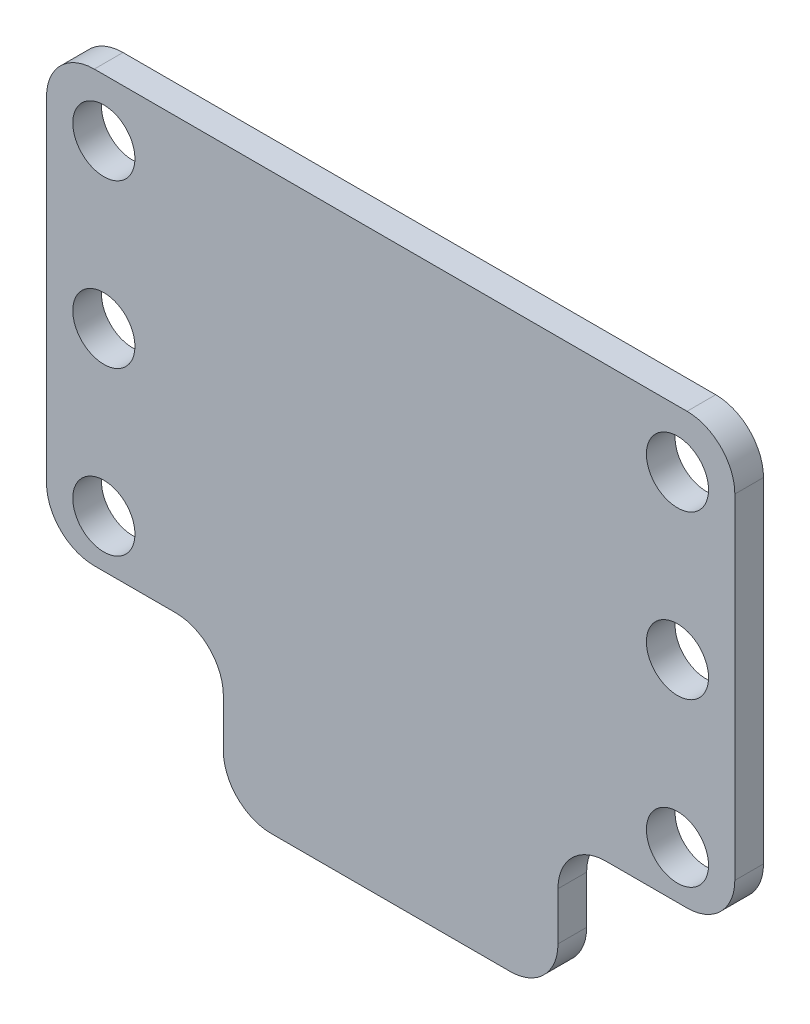
ISO-10303-21;
HEADER;
FILE_DESCRIPTION(('STEP AP214'),'2;1');
FILE_NAME('part.step','',(''),(''),'','','');
FILE_SCHEMA(('AUTOMOTIVE_DESIGN { 1 0 10303 214 1 1 1 1 }'));
ENDSEC;
DATA;
#1=APPLICATION_CONTEXT('core data for automotive mechanical design processes');
#2=APPLICATION_PROTOCOL_DEFINITION('international standard','automotive_design',2000,#1);
#3=PRODUCT_CONTEXT('',#1,'mechanical');
#4=PRODUCT('Part','Part','',(#3));
#5=PRODUCT_RELATED_PRODUCT_CATEGORY('part','',(#4));
#6=PRODUCT_DEFINITION_FORMATION('','',#4);
#7=PRODUCT_DEFINITION_CONTEXT('part definition',#1,'design');
#8=PRODUCT_DEFINITION('design','',#6,#7);
#9=PRODUCT_DEFINITION_SHAPE('','',#8);
#10=(LENGTH_UNIT() NAMED_UNIT(*) SI_UNIT(.MILLI.,.METRE.));
#11=(NAMED_UNIT(*) PLANE_ANGLE_UNIT() SI_UNIT($,.RADIAN.));
#12=(NAMED_UNIT(*) SI_UNIT($,.STERADIAN.) SOLID_ANGLE_UNIT());
#13=UNCERTAINTY_MEASURE_WITH_UNIT(LENGTH_MEASURE(1.E-05),#10,'distance_accuracy_value','');
#14=(GEOMETRIC_REPRESENTATION_CONTEXT(3) GLOBAL_UNCERTAINTY_ASSIGNED_CONTEXT((#13)) GLOBAL_UNIT_ASSIGNED_CONTEXT((#10,
#11,#12)) REPRESENTATION_CONTEXT('',''));
#15=CARTESIAN_POINT('',(0.,0.,0.));
#16=DIRECTION('',(0.,0.,1.));
#17=DIRECTION('',(1.,0.,0.));
#18=AXIS2_PLACEMENT_3D('',#15,#16,#17);
#19=CARTESIAN_POINT('',(0.,0.,3.));
#20=DIRECTION('',(0.,0.,-1.));
#21=DIRECTION('',(-1.,0.,0.));
#22=AXIS2_PLACEMENT_3D('',#19,#20,#21);
#23=PLANE('',#22);
#24=DIRECTION('',(-1.,0.,0.));
#25=VECTOR('',#24,1.);
#26=CARTESIAN_POINT('',(109.208492458902,1.90147341211937,3.));
#27=LINE('',#26,#25);
#28=CARTESIAN_POINT('',(104.208492458902,1.90147341211937,3.));
#29=VERTEX_POINT('',#28);
#30=CARTESIAN_POINT('',(42.2084924589015,1.90147341211937,3.));
#31=VERTEX_POINT('',#30);
#32=EDGE_CURVE('E286',#29,#31,#27,.T.);
#33=ORIENTED_EDGE('',*,*,#32,.T.);
#34=CARTESIAN_POINT('',(42.2084924589015,-3.09852658788063,3.));
#35=DIRECTION('',(0.,0.,-1.));
#36=DIRECTION('',(-1.,0.,0.));
#37=AXIS2_PLACEMENT_3D('',#34,#35,#36);
#38=CIRCLE('',#37,5.);
#39=CARTESIAN_POINT('',(37.2084924589015,-3.09852658788063,3.));
#40=VERTEX_POINT('',#39);
#41=EDGE_CURVE('E216',#31,#40,#38,.F.);
#42=ORIENTED_EDGE('',*,*,#41,.T.);
#43=DIRECTION('',(0.,-1.,0.));
#44=VECTOR('',#43,1.);
#45=CARTESIAN_POINT('',(37.2084924589015,1.90147341211937,3.));
#46=LINE('',#45,#44);
#47=CARTESIAN_POINT('',(37.2084924589015,-38.0985265878806,3.));
#48=VERTEX_POINT('',#47);
#49=EDGE_CURVE('E165',#40,#48,#46,.T.);
#50=ORIENTED_EDGE('',*,*,#49,.T.);
#51=CARTESIAN_POINT('',(42.2084924589015,-38.0985265878806,3.));
#52=DIRECTION('',(0.,0.,-1.));
#53=DIRECTION('',(-1.,0.,0.));
#54=AXIS2_PLACEMENT_3D('',#51,#52,#53);
#55=CIRCLE('',#54,5.);
#56=CARTESIAN_POINT('',(42.2084924589015,-43.0985265878806,3.));
#57=VERTEX_POINT('',#56);
#58=EDGE_CURVE('E214',#48,#57,#55,.F.);
#59=ORIENTED_EDGE('',*,*,#58,.T.);
#60=DIRECTION('',(1.,0.,0.));
#61=VECTOR('',#60,1.);
#62=CARTESIAN_POINT('',(55.7084924589017,-43.0985265878806,3.));
#63=LINE('',#62,#61);
#64=CARTESIAN_POINT('',(50.7084924589017,-43.0985265878806,3.));
#65=VERTEX_POINT('',#64);
#66=EDGE_CURVE('E290',#57,#65,#63,.T.);
#67=ORIENTED_EDGE('',*,*,#66,.T.);
#68=CARTESIAN_POINT('',(50.7084924589017,-48.0985265878806,3.));
#69=DIRECTION('',(0.,0.,-1.));
#70=DIRECTION('',(-1.,0.,0.));
#71=AXIS2_PLACEMENT_3D('',#68,#69,#70);
#72=CIRCLE('',#71,5.);
#73=CARTESIAN_POINT('',(55.7084924589017,-48.0985265878806,3.));
#74=VERTEX_POINT('',#73);
#75=EDGE_CURVE('E249',#65,#74,#72,.T.);
#76=ORIENTED_EDGE('',*,*,#75,.T.);
#77=DIRECTION('',(0.,-1.,0.));
#78=VECTOR('',#77,1.);
#79=CARTESIAN_POINT('',(55.7084924589017,-43.0985265878806,3.));
#80=LINE('',#79,#78);
#81=CARTESIAN_POINT('',(55.7084924589017,-53.0985265878806,3.));
#82=VERTEX_POINT('',#81);
#83=EDGE_CURVE('E293',#74,#82,#80,.T.);
#84=ORIENTED_EDGE('',*,*,#83,.T.);
#85=CARTESIAN_POINT('',(60.7084924589017,-53.0985265878806,3.));
#86=DIRECTION('',(0.,0.,-1.));
#87=DIRECTION('',(-1.,0.,0.));
#88=AXIS2_PLACEMENT_3D('',#85,#86,#87);
#89=CIRCLE('',#88,5.);
#90=CARTESIAN_POINT('',(60.7084924589017,-58.0985265878806,3.));
#91=VERTEX_POINT('',#90);
#92=EDGE_CURVE('E212',#82,#91,#89,.F.);
#93=ORIENTED_EDGE('',*,*,#92,.T.);
#94=DIRECTION('',(1.,0.,0.));
#95=VECTOR('',#94,1.);
#96=CARTESIAN_POINT('',(90.7084924589017,-58.0985265878806,3.));
#97=LINE('',#96,#95);
#98=CARTESIAN_POINT('',(85.7084924589017,-58.0985265878806,3.));
#99=VERTEX_POINT('',#98);
#100=EDGE_CURVE('E264',#91,#99,#97,.T.);
#101=ORIENTED_EDGE('',*,*,#100,.T.);
#102=CARTESIAN_POINT('',(85.7084924589017,-53.0985265878806,3.));
#103=DIRECTION('',(0.,0.,-1.));
#104=DIRECTION('',(-1.,0.,0.));
#105=AXIS2_PLACEMENT_3D('',#102,#103,#104);
#106=CIRCLE('',#105,5.);
#107=CARTESIAN_POINT('',(90.7084924589017,-53.0985265878806,3.));
#108=VERTEX_POINT('',#107);
#109=EDGE_CURVE('E210',#99,#108,#106,.F.);
#110=ORIENTED_EDGE('',*,*,#109,.T.);
#111=DIRECTION('',(0.,1.,0.));
#112=VECTOR('',#111,1.);
#113=CARTESIAN_POINT('',(90.7084924589017,-43.0985265878806,3.));
#114=LINE('',#113,#112);
#115=CARTESIAN_POINT('',(90.7084924589017,-48.0985265878806,3.));
#116=VERTEX_POINT('',#115);
#117=EDGE_CURVE('E262',#108,#116,#114,.T.);
#118=ORIENTED_EDGE('',*,*,#117,.T.);
#119=CARTESIAN_POINT('',(95.7084924589017,-48.0985265878806,3.));
#120=DIRECTION('',(0.,0.,-1.));
#121=DIRECTION('',(-1.,0.,0.));
#122=AXIS2_PLACEMENT_3D('',#119,#120,#121);
#123=CIRCLE('',#122,5.);
#124=CARTESIAN_POINT('',(95.7084924589017,-43.0985265878806,3.));
#125=VERTEX_POINT('',#124);
#126=EDGE_CURVE('E11',#116,#125,#123,.T.);
#127=ORIENTED_EDGE('',*,*,#126,.T.);
#128=DIRECTION('',(1.,0.,0.));
#129=VECTOR('',#128,1.);
#130=CARTESIAN_POINT('',(109.208492458902,-43.0985265878806,3.));
#131=LINE('',#130,#129);
#132=CARTESIAN_POINT('',(104.208492458902,-43.0985265878806,3.));
#133=VERTEX_POINT('',#132);
#134=EDGE_CURVE('E193',#125,#133,#131,.T.);
#135=ORIENTED_EDGE('',*,*,#134,.T.);
#136=CARTESIAN_POINT('',(104.208492458902,-38.0985265878806,3.));
#137=DIRECTION('',(0.,0.,-1.));
#138=DIRECTION('',(-1.,0.,0.));
#139=AXIS2_PLACEMENT_3D('',#136,#137,#138);
#140=CIRCLE('',#139,5.);
#141=CARTESIAN_POINT('',(109.208492458902,-38.0985265878806,3.));
#142=VERTEX_POINT('',#141);
#143=EDGE_CURVE('E208',#133,#142,#140,.F.);
#144=ORIENTED_EDGE('',*,*,#143,.T.);
#145=DIRECTION('',(0.,1.,0.));
#146=VECTOR('',#145,1.);
#147=CARTESIAN_POINT('',(109.208492458902,1.90147341211937,3.));
#148=LINE('',#147,#146);
#149=CARTESIAN_POINT('',(109.208492458902,-3.09852658788063,3.));
#150=VERTEX_POINT('',#149);
#151=EDGE_CURVE('E192',#142,#150,#148,.T.);
#152=ORIENTED_EDGE('',*,*,#151,.T.);
#153=CARTESIAN_POINT('',(104.208492458902,-3.09852658788063,3.));
#154=DIRECTION('',(0.,0.,-1.));
#155=DIRECTION('',(-1.,0.,0.));
#156=AXIS2_PLACEMENT_3D('',#153,#154,#155);
#157=CIRCLE('',#156,5.);
#158=EDGE_CURVE('E206',#150,#29,#157,.F.);
#159=ORIENTED_EDGE('',*,*,#158,.T.);
#160=EDGE_LOOP('',(#33,#42,#50,#59,#67,#76,#84,#93,#101,#110,#118,#127,#135,#144,#152,#159));
#161=FACE_BOUND('',#160,.T.);
#162=CARTESIAN_POINT('',(103.208492458902,-4.09852658788064,3.));
#163=DIRECTION('',(0.,0.,1.));
#164=DIRECTION('',(1.,0.,0.));
#165=AXIS2_PLACEMENT_3D('',#162,#163,#164);
#166=CIRCLE('',#165,3.25000000000001);
#167=CARTESIAN_POINT('',(106.458492458902,-4.09852658788064,3.));
#168=VERTEX_POINT('',#167);
#169=EDGE_CURVE('E268',#168,#168,#166,.T.);
#170=ORIENTED_EDGE('',*,*,#169,.F.);
#171=EDGE_LOOP('',(#170));
#172=FACE_BOUND('',#171,.T.);
#173=CARTESIAN_POINT('',(103.208492458902,-38.0985265878806,3.));
#174=DIRECTION('',(0.,0.,1.));
#175=DIRECTION('',(1.,0.,0.));
#176=AXIS2_PLACEMENT_3D('',#173,#174,#175);
#177=CIRCLE('',#176,3.25000000000001);
#178=CARTESIAN_POINT('',(106.458492458902,-38.0985265878806,3.));
#179=VERTEX_POINT('',#178);
#180=EDGE_CURVE('E278',#179,#179,#177,.T.);
#181=ORIENTED_EDGE('',*,*,#180,.F.);
#182=EDGE_LOOP('',(#181));
#183=FACE_BOUND('',#182,.T.);
#184=CARTESIAN_POINT('',(43.2084924589015,-38.0985265878802,3.));
#185=DIRECTION('',(0.,0.,1.));
#186=DIRECTION('',(1.,0.,0.));
#187=AXIS2_PLACEMENT_3D('',#184,#185,#186);
#188=CIRCLE('',#187,3.25000000000001);
#189=CARTESIAN_POINT('',(46.4584924589015,-38.0985265878802,3.));
#190=VERTEX_POINT('',#189);
#191=EDGE_CURVE('E563',#190,#190,#188,.T.);
#192=ORIENTED_EDGE('',*,*,#191,.F.);
#193=EDGE_LOOP('',(#192));
#194=FACE_BOUND('',#193,.T.);
#195=CARTESIAN_POINT('',(43.2084924589015,-4.09852658788018,3.));
#196=DIRECTION('',(0.,0.,1.));
#197=DIRECTION('',(1.,0.,0.));
#198=AXIS2_PLACEMENT_3D('',#195,#196,#197);
#199=CIRCLE('',#198,3.25);
#200=CARTESIAN_POINT('',(46.4584924589015,-4.09852658788018,3.));
#201=VERTEX_POINT('',#200);
#202=EDGE_CURVE('E557',#201,#201,#199,.T.);
#203=ORIENTED_EDGE('',*,*,#202,.F.);
#204=EDGE_LOOP('',(#203));
#205=FACE_BOUND('',#204,.T.);
#206=CARTESIAN_POINT('',(43.2084924589015,-21.0985265878802,3.));
#207=DIRECTION('',(0.,0.,1.));
#208=DIRECTION('',(1.,0.,0.));
#209=AXIS2_PLACEMENT_3D('',#206,#207,#208);
#210=CIRCLE('',#209,3.25);
#211=CARTESIAN_POINT('',(46.4584924589015,-21.0985265878802,3.));
#212=VERTEX_POINT('',#211);
#213=EDGE_CURVE('E551',#212,#212,#210,.T.);
#214=ORIENTED_EDGE('',*,*,#213,.F.);
#215=EDGE_LOOP('',(#214));
#216=FACE_BOUND('',#215,.T.);
#217=CARTESIAN_POINT('',(103.208492458902,-21.0985265878802,3.));
#218=DIRECTION('',(0.,0.,1.));
#219=DIRECTION('',(1.,0.,0.));
#220=AXIS2_PLACEMENT_3D('',#217,#218,#219);
#221=CIRCLE('',#220,3.25000000000001);
#222=CARTESIAN_POINT('',(106.458492458902,-21.0985265878802,3.));
#223=VERTEX_POINT('',#222);
#224=EDGE_CURVE('E542',#223,#223,#221,.T.);
#225=ORIENTED_EDGE('',*,*,#224,.F.);
#226=EDGE_LOOP('',(#225));
#227=FACE_BOUND('',#226,.T.);
#228=ADVANCED_FACE('F32',(#161,#172,#183,#194,#205,#216,#227),#23,.F.);
#229=CARTESIAN_POINT('',(0.,0.,0.));
#230=DIRECTION('',(0.,0.,-1.));
#231=DIRECTION('',(-1.,0.,0.));
#232=AXIS2_PLACEMENT_3D('',#229,#230,#231);
#233=PLANE('',#232);
#234=CARTESIAN_POINT('',(43.2084924589015,-21.0985265878802,0.));
#235=DIRECTION('',(0.,0.,1.));
#236=DIRECTION('',(1.,0.,0.));
#237=AXIS2_PLACEMENT_3D('',#234,#235,#236);
#238=CIRCLE('',#237,3.25);
#239=CARTESIAN_POINT('',(46.4584924589015,-21.0985265878802,0.));
#240=VERTEX_POINT('',#239);
#241=EDGE_CURVE('E548',#240,#240,#238,.T.);
#242=ORIENTED_EDGE('',*,*,#241,.T.);
#243=EDGE_LOOP('',(#242));
#244=FACE_BOUND('',#243,.T.);
#245=CARTESIAN_POINT('',(43.2084924589015,-38.0985265878802,0.));
#246=DIRECTION('',(0.,0.,1.));
#247=DIRECTION('',(1.,0.,0.));
#248=AXIS2_PLACEMENT_3D('',#245,#246,#247);
#249=CIRCLE('',#248,3.25000000000001);
#250=CARTESIAN_POINT('',(46.4584924589015,-38.0985265878802,0.));
#251=VERTEX_POINT('',#250);
#252=EDGE_CURVE('E560',#251,#251,#249,.T.);
#253=ORIENTED_EDGE('',*,*,#252,.T.);
#254=EDGE_LOOP('',(#253));
#255=FACE_BOUND('',#254,.T.);
#256=CARTESIAN_POINT('',(103.208492458902,-4.09852658788064,0.));
#257=DIRECTION('',(0.,0.,1.));
#258=DIRECTION('',(1.,0.,0.));
#259=AXIS2_PLACEMENT_3D('',#256,#257,#258);
#260=CIRCLE('',#259,3.25000000000001);
#261=CARTESIAN_POINT('',(106.458492458902,-4.09852658788064,0.));
#262=VERTEX_POINT('',#261);
#263=EDGE_CURVE('E273',#262,#262,#260,.T.);
#264=ORIENTED_EDGE('',*,*,#263,.T.);
#265=EDGE_LOOP('',(#264));
#266=FACE_BOUND('',#265,.T.);
#267=DIRECTION('',(0.,-1.,0.));
#268=VECTOR('',#267,1.);
#269=CARTESIAN_POINT('',(37.2084924589015,1.90147341211937,0.));
#270=LINE('',#269,#268);
#271=CARTESIAN_POINT('',(37.2084924589015,-3.09852658788063,0.));
#272=VERTEX_POINT('',#271);
#273=CARTESIAN_POINT('',(37.2084924589015,-38.0985265878806,0.));
#274=VERTEX_POINT('',#273);
#275=EDGE_CURVE('E162',#272,#274,#270,.T.);
#276=ORIENTED_EDGE('',*,*,#275,.F.);
#277=CARTESIAN_POINT('',(42.2084924589015,-3.09852658788063,0.));
#278=DIRECTION('',(0.,0.,-1.));
#279=DIRECTION('',(-1.,0.,0.));
#280=AXIS2_PLACEMENT_3D('',#277,#278,#279);
#281=CIRCLE('',#280,5.);
#282=CARTESIAN_POINT('',(42.2084924589015,1.90147341211937,0.));
#283=VERTEX_POINT('',#282);
#284=EDGE_CURVE('E145',#272,#283,#281,.T.);
#285=ORIENTED_EDGE('',*,*,#284,.T.);
#286=DIRECTION('',(-1.,0.,0.));
#287=VECTOR('',#286,1.);
#288=CARTESIAN_POINT('',(109.208492458902,1.90147341211937,0.));
#289=LINE('',#288,#287);
#290=CARTESIAN_POINT('',(104.208492458902,1.90147341211937,0.));
#291=VERTEX_POINT('',#290);
#292=EDGE_CURVE('E173',#291,#283,#289,.T.);
#293=ORIENTED_EDGE('',*,*,#292,.F.);
#294=CARTESIAN_POINT('',(104.208492458902,-3.09852658788063,0.));
#295=DIRECTION('',(0.,0.,-1.));
#296=DIRECTION('',(-1.,0.,0.));
#297=AXIS2_PLACEMENT_3D('',#294,#295,#296);
#298=CIRCLE('',#297,5.);
#299=CARTESIAN_POINT('',(109.208492458902,-3.09852658788063,0.));
#300=VERTEX_POINT('',#299);
#301=EDGE_CURVE('E166',#291,#300,#298,.T.);
#302=ORIENTED_EDGE('',*,*,#301,.T.);
#303=DIRECTION('',(0.,1.,0.));
#304=VECTOR('',#303,1.);
#305=CARTESIAN_POINT('',(109.208492458902,1.90147341211937,0.));
#306=LINE('',#305,#304);
#307=CARTESIAN_POINT('',(109.208492458902,-38.0985265878806,0.));
#308=VERTEX_POINT('',#307);
#309=EDGE_CURVE('E178',#308,#300,#306,.T.);
#310=ORIENTED_EDGE('',*,*,#309,.F.);
#311=CARTESIAN_POINT('',(104.208492458902,-38.0985265878806,0.));
#312=DIRECTION('',(0.,0.,-1.));
#313=DIRECTION('',(-1.,0.,0.));
#314=AXIS2_PLACEMENT_3D('',#311,#312,#313);
#315=CIRCLE('',#314,5.);
#316=CARTESIAN_POINT('',(104.208492458902,-43.0985265878806,0.));
#317=VERTEX_POINT('',#316);
#318=EDGE_CURVE('E196',#308,#317,#315,.T.);
#319=ORIENTED_EDGE('',*,*,#318,.T.);
#320=DIRECTION('',(1.,0.,0.));
#321=VECTOR('',#320,1.);
#322=CARTESIAN_POINT('',(109.208492458902,-43.0985265878806,0.));
#323=LINE('',#322,#321);
#324=CARTESIAN_POINT('',(95.7084924589017,-43.0985265878806,0.));
#325=VERTEX_POINT('',#324);
#326=EDGE_CURVE('E190',#325,#317,#323,.T.);
#327=ORIENTED_EDGE('',*,*,#326,.F.);
#328=CARTESIAN_POINT('',(95.7084924589017,-48.0985265878806,0.));
#329=DIRECTION('',(0.,0.,-1.));
#330=DIRECTION('',(-1.,0.,0.));
#331=AXIS2_PLACEMENT_3D('',#328,#329,#330);
#332=CIRCLE('',#331,5.);
#333=CARTESIAN_POINT('',(90.7084924589017,-48.0985265878806,0.));
#334=VERTEX_POINT('',#333);
#335=EDGE_CURVE('E40',#325,#334,#332,.F.);
#336=ORIENTED_EDGE('',*,*,#335,.T.);
#337=DIRECTION('',(0.,1.,0.));
#338=VECTOR('',#337,1.);
#339=CARTESIAN_POINT('',(90.7084924589017,-43.0985265878806,0.));
#340=LINE('',#339,#338);
#341=CARTESIAN_POINT('',(90.7084924589017,-53.0985265878806,0.));
#342=VERTEX_POINT('',#341);
#343=EDGE_CURVE('E187',#342,#334,#340,.T.);
#344=ORIENTED_EDGE('',*,*,#343,.F.);
#345=CARTESIAN_POINT('',(85.7084924589017,-53.0985265878806,0.));
#346=DIRECTION('',(0.,0.,-1.));
#347=DIRECTION('',(-1.,0.,0.));
#348=AXIS2_PLACEMENT_3D('',#345,#346,#347);
#349=CIRCLE('',#348,5.);
#350=CARTESIAN_POINT('',(85.7084924589017,-58.0985265878806,0.));
#351=VERTEX_POINT('',#350);
#352=EDGE_CURVE('E198',#342,#351,#349,.T.);
#353=ORIENTED_EDGE('',*,*,#352,.T.);
#354=DIRECTION('',(1.,0.,0.));
#355=VECTOR('',#354,1.);
#356=CARTESIAN_POINT('',(90.7084924589017,-58.0985265878806,0.));
#357=LINE('',#356,#355);
#358=CARTESIAN_POINT('',(60.7084924589017,-58.0985265878806,0.));
#359=VERTEX_POINT('',#358);
#360=EDGE_CURVE('E184',#359,#351,#357,.T.);
#361=ORIENTED_EDGE('',*,*,#360,.F.);
#362=CARTESIAN_POINT('',(60.7084924589017,-53.0985265878806,0.));
#363=DIRECTION('',(0.,0.,-1.));
#364=DIRECTION('',(-1.,0.,0.));
#365=AXIS2_PLACEMENT_3D('',#362,#363,#364);
#366=CIRCLE('',#365,5.);
#367=CARTESIAN_POINT('',(55.7084924589017,-53.0985265878806,0.));
#368=VERTEX_POINT('',#367);
#369=EDGE_CURVE('E200',#359,#368,#366,.T.);
#370=ORIENTED_EDGE('',*,*,#369,.T.);
#371=DIRECTION('',(0.,-1.,0.));
#372=VECTOR('',#371,1.);
#373=CARTESIAN_POINT('',(55.7084924589017,-43.0985265878806,0.));
#374=LINE('',#373,#372);
#375=CARTESIAN_POINT('',(55.7084924589017,-48.0985265878806,0.));
#376=VERTEX_POINT('',#375);
#377=EDGE_CURVE('E176',#376,#368,#374,.T.);
#378=ORIENTED_EDGE('',*,*,#377,.F.);
#379=CARTESIAN_POINT('',(50.7084924589017,-48.0985265878806,0.));
#380=DIRECTION('',(0.,0.,-1.));
#381=DIRECTION('',(-1.,0.,0.));
#382=AXIS2_PLACEMENT_3D('',#379,#380,#381);
#383=CIRCLE('',#382,5.);
#384=CARTESIAN_POINT('',(50.7084924589017,-43.0985265878806,0.));
#385=VERTEX_POINT('',#384);
#386=EDGE_CURVE('E247',#376,#385,#383,.F.);
#387=ORIENTED_EDGE('',*,*,#386,.T.);
#388=DIRECTION('',(1.,0.,0.));
#389=VECTOR('',#388,1.);
#390=CARTESIAN_POINT('',(55.7084924589017,-43.0985265878806,0.));
#391=LINE('',#390,#389);
#392=CARTESIAN_POINT('',(42.2084924589015,-43.0985265878806,0.));
#393=VERTEX_POINT('',#392);
#394=EDGE_CURVE('E172',#393,#385,#391,.T.);
#395=ORIENTED_EDGE('',*,*,#394,.F.);
#396=CARTESIAN_POINT('',(42.2084924589015,-38.0985265878806,0.));
#397=DIRECTION('',(0.,0.,-1.));
#398=DIRECTION('',(-1.,0.,0.));
#399=AXIS2_PLACEMENT_3D('',#396,#397,#398);
#400=CIRCLE('',#399,5.);
#401=EDGE_CURVE('E156',#393,#274,#400,.T.);
#402=ORIENTED_EDGE('',*,*,#401,.T.);
#403=EDGE_LOOP('',(#276,#285,#293,#302,#310,#319,#327,#336,#344,#353,#361,#370,#378,#387,#395,#402));
#404=FACE_BOUND('',#403,.T.);
#405=CARTESIAN_POINT('',(103.208492458902,-38.0985265878806,0.));
#406=DIRECTION('',(0.,0.,1.));
#407=DIRECTION('',(1.,0.,0.));
#408=AXIS2_PLACEMENT_3D('',#405,#406,#407);
#409=CIRCLE('',#408,3.25000000000001);
#410=CARTESIAN_POINT('',(106.458492458902,-38.0985265878806,0.));
#411=VERTEX_POINT('',#410);
#412=EDGE_CURVE('E281',#411,#411,#409,.T.);
#413=ORIENTED_EDGE('',*,*,#412,.T.);
#414=EDGE_LOOP('',(#413));
#415=FACE_BOUND('',#414,.T.);
#416=CARTESIAN_POINT('',(43.2084924589015,-4.09852658788018,0.));
#417=DIRECTION('',(0.,0.,1.));
#418=DIRECTION('',(1.,0.,0.));
#419=AXIS2_PLACEMENT_3D('',#416,#417,#418);
#420=CIRCLE('',#419,3.25);
#421=CARTESIAN_POINT('',(46.4584924589015,-4.09852658788018,0.));
#422=VERTEX_POINT('',#421);
#423=EDGE_CURVE('E554',#422,#422,#420,.T.);
#424=ORIENTED_EDGE('',*,*,#423,.T.);
#425=EDGE_LOOP('',(#424));
#426=FACE_BOUND('',#425,.T.);
#427=CARTESIAN_POINT('',(103.208492458902,-21.0985265878802,0.));
#428=DIRECTION('',(0.,0.,1.));
#429=DIRECTION('',(1.,0.,0.));
#430=AXIS2_PLACEMENT_3D('',#427,#428,#429);
#431=CIRCLE('',#430,3.25000000000001);
#432=CARTESIAN_POINT('',(106.458492458902,-21.0985265878802,0.));
#433=VERTEX_POINT('',#432);
#434=EDGE_CURVE('E545',#433,#433,#431,.T.);
#435=ORIENTED_EDGE('',*,*,#434,.T.);
#436=EDGE_LOOP('',(#435));
#437=FACE_BOUND('',#436,.T.);
#438=ADVANCED_FACE('F169',(#244,#255,#266,#404,#415,#426,#437),#233,.T.);
#439=CARTESIAN_POINT('',(109.208492458902,1.90147341211937,3.));
#440=DIRECTION('',(-1.,0.,0.));
#441=DIRECTION('',(0.,0.,1.));
#442=AXIS2_PLACEMENT_3D('',#439,#440,#441);
#443=PLANE('',#442);
#444=ORIENTED_EDGE('',*,*,#151,.F.);
#445=DIRECTION('',(0.,0.,-1.));
#446=VECTOR('',#445,1.);
#447=CARTESIAN_POINT('',(109.208492458902,-38.0985265878806,3.));
#448=LINE('',#447,#446);
#449=EDGE_CURVE('E244',#142,#308,#448,.T.);
#450=ORIENTED_EDGE('',*,*,#449,.T.);
#451=ORIENTED_EDGE('',*,*,#309,.T.);
#452=DIRECTION('',(0.,0.,-1.));
#453=VECTOR('',#452,1.);
#454=CARTESIAN_POINT('',(109.208492458902,-3.09852658788063,3.));
#455=LINE('',#454,#453);
#456=EDGE_CURVE('E242',#300,#150,#455,.F.);
#457=ORIENTED_EDGE('',*,*,#456,.T.);
#458=EDGE_LOOP('',(#444,#450,#451,#457));
#459=FACE_BOUND('',#458,.T.);
#460=ADVANCED_FACE('F336',(#459),#443,.F.);
#461=CARTESIAN_POINT('',(109.208492458902,1.90147341211937,3.));
#462=DIRECTION('',(0.,-1.,0.));
#463=DIRECTION('',(0.,0.,-1.));
#464=AXIS2_PLACEMENT_3D('',#461,#462,#463);
#465=PLANE('',#464);
#466=ORIENTED_EDGE('',*,*,#292,.T.);
#467=DIRECTION('',(0.,0.,-1.));
#468=VECTOR('',#467,1.);
#469=CARTESIAN_POINT('',(42.2084924589015,1.90147341211937,3.));
#470=LINE('',#469,#468);
#471=EDGE_CURVE('E150',#283,#31,#470,.F.);
#472=ORIENTED_EDGE('',*,*,#471,.T.);
#473=ORIENTED_EDGE('',*,*,#32,.F.);
#474=DIRECTION('',(0.,0.,-1.));
#475=VECTOR('',#474,1.);
#476=CARTESIAN_POINT('',(104.208492458902,1.90147341211937,3.));
#477=LINE('',#476,#475);
#478=EDGE_CURVE('E155',#29,#291,#477,.T.);
#479=ORIENTED_EDGE('',*,*,#478,.T.);
#480=EDGE_LOOP('',(#466,#472,#473,#479));
#481=FACE_BOUND('',#480,.T.);
#482=ADVANCED_FACE('F330',(#481),#465,.F.);
#483=CARTESIAN_POINT('',(37.2084924589015,1.90147341211937,3.));
#484=DIRECTION('',(1.,0.,0.));
#485=DIRECTION('',(0.,0.,-1.));
#486=AXIS2_PLACEMENT_3D('',#483,#484,#485);
#487=PLANE('',#486);
#488=ORIENTED_EDGE('',*,*,#49,.F.);
#489=DIRECTION('',(0.,0.,-1.));
#490=VECTOR('',#489,1.);
#491=CARTESIAN_POINT('',(37.2084924589015,-3.09852658788063,3.));
#492=LINE('',#491,#490);
#493=EDGE_CURVE('E149',#40,#272,#492,.T.);
#494=ORIENTED_EDGE('',*,*,#493,.T.);
#495=ORIENTED_EDGE('',*,*,#275,.T.);
#496=DIRECTION('',(0.,0.,-1.));
#497=VECTOR('',#496,1.);
#498=CARTESIAN_POINT('',(37.2084924589015,-38.0985265878806,3.));
#499=LINE('',#498,#497);
#500=EDGE_CURVE('E167',#274,#48,#499,.F.);
#501=ORIENTED_EDGE('',*,*,#500,.T.);
#502=EDGE_LOOP('',(#488,#494,#495,#501));
#503=FACE_BOUND('',#502,.T.);
#504=ADVANCED_FACE('F161',(#503),#487,.F.);
#505=CARTESIAN_POINT('',(55.7084924589017,-43.0985265878806,3.));
#506=DIRECTION('',(0.,1.,0.));
#507=DIRECTION('',(0.,0.,1.));
#508=AXIS2_PLACEMENT_3D('',#505,#506,#507);
#509=PLANE('',#508);
#510=ORIENTED_EDGE('',*,*,#66,.F.);
#511=DIRECTION('',(0.,0.,-1.));
#512=VECTOR('',#511,1.);
#513=CARTESIAN_POINT('',(42.2084924589015,-43.0985265878806,3.));
#514=LINE('',#513,#512);
#515=EDGE_CURVE('E220',#57,#393,#514,.T.);
#516=ORIENTED_EDGE('',*,*,#515,.T.);
#517=ORIENTED_EDGE('',*,*,#394,.T.);
#518=DIRECTION('',(0.,0.,-1.));
#519=VECTOR('',#518,1.);
#520=CARTESIAN_POINT('',(50.7084924589017,-43.0985265878806,3.));
#521=LINE('',#520,#519);
#522=EDGE_CURVE('E218',#385,#65,#521,.F.);
#523=ORIENTED_EDGE('',*,*,#522,.T.);
#524=EDGE_LOOP('',(#510,#516,#517,#523));
#525=FACE_BOUND('',#524,.T.);
#526=ADVANCED_FACE('F321',(#525),#509,.F.);
#527=CARTESIAN_POINT('',(55.7084924589017,-43.0985265878806,3.));
#528=DIRECTION('',(1.,0.,0.));
#529=DIRECTION('',(0.,0.,-1.));
#530=AXIS2_PLACEMENT_3D('',#527,#528,#529);
#531=PLANE('',#530);
#532=ORIENTED_EDGE('',*,*,#377,.T.);
#533=DIRECTION('',(0.,0.,-1.));
#534=VECTOR('',#533,1.);
#535=CARTESIAN_POINT('',(55.7084924589017,-53.0985265878806,3.));
#536=LINE('',#535,#534);
#537=EDGE_CURVE('E231',#368,#82,#536,.F.);
#538=ORIENTED_EDGE('',*,*,#537,.T.);
#539=ORIENTED_EDGE('',*,*,#83,.F.);
#540=DIRECTION('',(0.,0.,-1.));
#541=VECTOR('',#540,1.);
#542=CARTESIAN_POINT('',(55.7084924589017,-48.0985265878806,0.));
#543=LINE('',#542,#541);
#544=EDGE_CURVE('E228',#74,#376,#543,.T.);
#545=ORIENTED_EDGE('',*,*,#544,.T.);
#546=EDGE_LOOP('',(#532,#538,#539,#545));
#547=FACE_BOUND('',#546,.T.);
#548=ADVANCED_FACE('F312',(#547),#531,.F.);
#549=CARTESIAN_POINT('',(90.7084924589017,-58.0985265878806,3.));
#550=DIRECTION('',(0.,1.,0.));
#551=DIRECTION('',(0.,0.,1.));
#552=AXIS2_PLACEMENT_3D('',#549,#550,#551);
#553=PLANE('',#552);
#554=ORIENTED_EDGE('',*,*,#100,.F.);
#555=DIRECTION('',(0.,0.,-1.));
#556=VECTOR('',#555,1.);
#557=CARTESIAN_POINT('',(60.7084924589017,-58.0985265878806,3.));
#558=LINE('',#557,#556);
#559=EDGE_CURVE('E225',#91,#359,#558,.T.);
#560=ORIENTED_EDGE('',*,*,#559,.T.);
#561=ORIENTED_EDGE('',*,*,#360,.T.);
#562=DIRECTION('',(0.,0.,-1.));
#563=VECTOR('',#562,1.);
#564=CARTESIAN_POINT('',(85.7084924589017,-58.0985265878806,3.));
#565=LINE('',#564,#563);
#566=EDGE_CURVE('E223',#351,#99,#565,.F.);
#567=ORIENTED_EDGE('',*,*,#566,.T.);
#568=EDGE_LOOP('',(#554,#560,#561,#567));
#569=FACE_BOUND('',#568,.T.);
#570=ADVANCED_FACE('F306',(#569),#553,.F.);
#571=CARTESIAN_POINT('',(90.7084924589017,-43.0985265878806,3.));
#572=DIRECTION('',(-1.,0.,0.));
#573=DIRECTION('',(0.,-1.,0.));
#574=AXIS2_PLACEMENT_3D('',#571,#572,#573);
#575=PLANE('',#574);
#576=ORIENTED_EDGE('',*,*,#117,.F.);
#577=DIRECTION('',(0.,0.,-1.));
#578=VECTOR('',#577,1.);
#579=CARTESIAN_POINT('',(90.7084924589017,-53.0985265878806,3.));
#580=LINE('',#579,#578);
#581=EDGE_CURVE('E235',#108,#342,#580,.T.);
#582=ORIENTED_EDGE('',*,*,#581,.T.);
#583=ORIENTED_EDGE('',*,*,#343,.T.);
#584=DIRECTION('',(0.,0.,-1.));
#585=VECTOR('',#584,1.);
#586=CARTESIAN_POINT('',(90.7084924589017,-48.0985265878806,3.));
#587=LINE('',#586,#585);
#588=EDGE_CURVE('E233',#334,#116,#587,.F.);
#589=ORIENTED_EDGE('',*,*,#588,.T.);
#590=EDGE_LOOP('',(#576,#582,#583,#589));
#591=FACE_BOUND('',#590,.T.);
#592=ADVANCED_FACE('F257',(#591),#575,.F.);
#593=CARTESIAN_POINT('',(109.208492458902,-43.0985265878806,3.));
#594=DIRECTION('',(0.,1.,0.));
#595=DIRECTION('',(0.,0.,1.));
#596=AXIS2_PLACEMENT_3D('',#593,#594,#595);
#597=PLANE('',#596);
#598=ORIENTED_EDGE('',*,*,#134,.F.);
#599=DIRECTION('',(0.,0.,-1.));
#600=VECTOR('',#599,1.);
#601=CARTESIAN_POINT('',(95.7084924589017,-43.0985265878806,0.));
#602=LINE('',#601,#600);
#603=EDGE_CURVE('E239',#125,#325,#602,.T.);
#604=ORIENTED_EDGE('',*,*,#603,.T.);
#605=ORIENTED_EDGE('',*,*,#326,.T.);
#606=DIRECTION('',(0.,0.,-1.));
#607=VECTOR('',#606,1.);
#608=CARTESIAN_POINT('',(104.208492458902,-43.0985265878806,3.));
#609=LINE('',#608,#607);
#610=EDGE_CURVE('E47',#317,#133,#609,.F.);
#611=ORIENTED_EDGE('',*,*,#610,.T.);
#612=EDGE_LOOP('',(#598,#604,#605,#611));
#613=FACE_BOUND('',#612,.T.);
#614=ADVANCED_FACE('F260',(#613),#597,.F.);
#615=CARTESIAN_POINT('',(103.208492458902,-4.09852658788064,3.));
#616=DIRECTION('',(0.,0.,-1.));
#617=DIRECTION('',(-1.,0.,0.));
#618=AXIS2_PLACEMENT_3D('',#615,#616,#617);
#619=CYLINDRICAL_SURFACE('',#618,3.25000000000001);
#620=ORIENTED_EDGE('',*,*,#169,.T.);
#621=EDGE_LOOP('',(#620));
#622=FACE_BOUND('',#621,.T.);
#623=ORIENTED_EDGE('',*,*,#263,.F.);
#624=EDGE_LOOP('',(#623));
#625=FACE_BOUND('',#624,.T.);
#626=ADVANCED_FACE('F352',(#622,#625),#619,.F.);
#627=CARTESIAN_POINT('',(103.208492458902,-38.0985265878806,3.));
#628=DIRECTION('',(0.,0.,-1.));
#629=DIRECTION('',(-1.,0.,0.));
#630=AXIS2_PLACEMENT_3D('',#627,#628,#629);
#631=CYLINDRICAL_SURFACE('',#630,3.25000000000001);
#632=ORIENTED_EDGE('',*,*,#180,.T.);
#633=EDGE_LOOP('',(#632));
#634=FACE_BOUND('',#633,.T.);
#635=ORIENTED_EDGE('',*,*,#412,.F.);
#636=EDGE_LOOP('',(#635));
#637=FACE_BOUND('',#636,.T.);
#638=ADVANCED_FACE('F397',(#634,#637),#631,.F.);
#639=CARTESIAN_POINT('',(43.2084924589015,-38.0985265878802,3.));
#640=DIRECTION('',(0.,0.,-1.));
#641=DIRECTION('',(-1.,0.,0.));
#642=AXIS2_PLACEMENT_3D('',#639,#640,#641);
#643=CYLINDRICAL_SURFACE('',#642,3.25000000000001);
#644=ORIENTED_EDGE('',*,*,#191,.T.);
#645=EDGE_LOOP('',(#644));
#646=FACE_BOUND('',#645,.T.);
#647=ORIENTED_EDGE('',*,*,#252,.F.);
#648=EDGE_LOOP('',(#647));
#649=FACE_BOUND('',#648,.T.);
#650=ADVANCED_FACE('F403',(#646,#649),#643,.F.);
#651=CARTESIAN_POINT('',(43.2084924589015,-4.09852658788018,3.));
#652=DIRECTION('',(0.,0.,-1.));
#653=DIRECTION('',(-1.,0.,0.));
#654=AXIS2_PLACEMENT_3D('',#651,#652,#653);
#655=CYLINDRICAL_SURFACE('',#654,3.25);
#656=ORIENTED_EDGE('',*,*,#202,.T.);
#657=EDGE_LOOP('',(#656));
#658=FACE_BOUND('',#657,.T.);
#659=ORIENTED_EDGE('',*,*,#423,.F.);
#660=EDGE_LOOP('',(#659));
#661=FACE_BOUND('',#660,.T.);
#662=ADVANCED_FACE('F410',(#658,#661),#655,.F.);
#663=CARTESIAN_POINT('',(43.2084924589015,-21.0985265878802,3.));
#664=DIRECTION('',(0.,0.,-1.));
#665=DIRECTION('',(-1.,0.,0.));
#666=AXIS2_PLACEMENT_3D('',#663,#664,#665);
#667=CYLINDRICAL_SURFACE('',#666,3.25);
#668=ORIENTED_EDGE('',*,*,#213,.T.);
#669=EDGE_LOOP('',(#668));
#670=FACE_BOUND('',#669,.T.);
#671=ORIENTED_EDGE('',*,*,#241,.F.);
#672=EDGE_LOOP('',(#671));
#673=FACE_BOUND('',#672,.T.);
#674=ADVANCED_FACE('F418',(#670,#673),#667,.F.);
#675=CARTESIAN_POINT('',(103.208492458902,-21.0985265878802,3.));
#676=DIRECTION('',(0.,0.,-1.));
#677=DIRECTION('',(-1.,0.,0.));
#678=AXIS2_PLACEMENT_3D('',#675,#676,#677);
#679=CYLINDRICAL_SURFACE('',#678,3.25000000000001);
#680=ORIENTED_EDGE('',*,*,#224,.T.);
#681=EDGE_LOOP('',(#680));
#682=FACE_BOUND('',#681,.T.);
#683=ORIENTED_EDGE('',*,*,#434,.F.);
#684=EDGE_LOOP('',(#683));
#685=FACE_BOUND('',#684,.T.);
#686=ADVANCED_FACE('F426',(#682,#685),#679,.F.);
#687=CARTESIAN_POINT('',(42.2084924589015,-3.09852658788063,3.));
#688=DIRECTION('',(0.,0.,-1.));
#689=DIRECTION('',(-1.,0.,0.));
#690=AXIS2_PLACEMENT_3D('',#687,#688,#689);
#691=CYLINDRICAL_SURFACE('',#690,5.);
#692=ORIENTED_EDGE('',*,*,#41,.F.);
#693=ORIENTED_EDGE('',*,*,#471,.F.);
#694=ORIENTED_EDGE('',*,*,#284,.F.);
#695=ORIENTED_EDGE('',*,*,#493,.F.);
#696=EDGE_LOOP('',(#692,#693,#694,#695));
#697=FACE_BOUND('',#696,.T.);
#698=ADVANCED_FACE('F148',(#697),#691,.T.);
#699=CARTESIAN_POINT('',(42.2084924589015,-38.0985265878806,3.));
#700=DIRECTION('',(0.,0.,-1.));
#701=DIRECTION('',(-1.,0.,0.));
#702=AXIS2_PLACEMENT_3D('',#699,#700,#701);
#703=CYLINDRICAL_SURFACE('',#702,5.);
#704=ORIENTED_EDGE('',*,*,#58,.F.);
#705=ORIENTED_EDGE('',*,*,#500,.F.);
#706=ORIENTED_EDGE('',*,*,#401,.F.);
#707=ORIENTED_EDGE('',*,*,#515,.F.);
#708=EDGE_LOOP('',(#704,#705,#706,#707));
#709=FACE_BOUND('',#708,.T.);
#710=ADVANCED_FACE('F325',(#709),#703,.T.);
#711=CARTESIAN_POINT('',(60.7084924589017,-53.0985265878806,3.));
#712=DIRECTION('',(0.,0.,-1.));
#713=DIRECTION('',(-1.,0.,0.));
#714=AXIS2_PLACEMENT_3D('',#711,#712,#713);
#715=CYLINDRICAL_SURFACE('',#714,5.);
#716=ORIENTED_EDGE('',*,*,#92,.F.);
#717=ORIENTED_EDGE('',*,*,#537,.F.);
#718=ORIENTED_EDGE('',*,*,#369,.F.);
#719=ORIENTED_EDGE('',*,*,#559,.F.);
#720=EDGE_LOOP('',(#716,#717,#718,#719));
#721=FACE_BOUND('',#720,.T.);
#722=ADVANCED_FACE('F308',(#721),#715,.T.);
#723=CARTESIAN_POINT('',(50.7084924589017,-48.0985265878806,3.));
#724=DIRECTION('',(0.,0.,1.));
#725=DIRECTION('',(1.,0.,0.));
#726=AXIS2_PLACEMENT_3D('',#723,#724,#725);
#727=CYLINDRICAL_SURFACE('',#726,5.);
#728=ORIENTED_EDGE('',*,*,#75,.F.);
#729=ORIENTED_EDGE('',*,*,#522,.F.);
#730=ORIENTED_EDGE('',*,*,#386,.F.);
#731=ORIENTED_EDGE('',*,*,#544,.F.);
#732=EDGE_LOOP('',(#728,#729,#730,#731));
#733=FACE_BOUND('',#732,.T.);
#734=ADVANCED_FACE('F317',(#733),#727,.F.);
#735=CARTESIAN_POINT('',(85.7084924589017,-53.0985265878806,3.));
#736=DIRECTION('',(0.,0.,-1.));
#737=DIRECTION('',(-1.,0.,0.));
#738=AXIS2_PLACEMENT_3D('',#735,#736,#737);
#739=CYLINDRICAL_SURFACE('',#738,5.);
#740=ORIENTED_EDGE('',*,*,#109,.F.);
#741=ORIENTED_EDGE('',*,*,#566,.F.);
#742=ORIENTED_EDGE('',*,*,#352,.F.);
#743=ORIENTED_EDGE('',*,*,#581,.F.);
#744=EDGE_LOOP('',(#740,#741,#742,#743));
#745=FACE_BOUND('',#744,.T.);
#746=ADVANCED_FACE('F304',(#745),#739,.T.);
#747=CARTESIAN_POINT('',(95.7084924589017,-48.0985265878806,3.));
#748=DIRECTION('',(0.,0.,1.));
#749=DIRECTION('',(1.,0.,0.));
#750=AXIS2_PLACEMENT_3D('',#747,#748,#749);
#751=CYLINDRICAL_SURFACE('',#750,5.);
#752=ORIENTED_EDGE('',*,*,#126,.F.);
#753=ORIENTED_EDGE('',*,*,#588,.F.);
#754=ORIENTED_EDGE('',*,*,#335,.F.);
#755=ORIENTED_EDGE('',*,*,#603,.F.);
#756=EDGE_LOOP('',(#752,#753,#754,#755));
#757=FACE_BOUND('',#756,.T.);
#758=ADVANCED_FACE('F259',(#757),#751,.F.);
#759=CARTESIAN_POINT('',(104.208492458902,-38.0985265878806,3.));
#760=DIRECTION('',(0.,0.,-1.));
#761=DIRECTION('',(-1.,0.,0.));
#762=AXIS2_PLACEMENT_3D('',#759,#760,#761);
#763=CYLINDRICAL_SURFACE('',#762,5.);
#764=ORIENTED_EDGE('',*,*,#143,.F.);
#765=ORIENTED_EDGE('',*,*,#610,.F.);
#766=ORIENTED_EDGE('',*,*,#318,.F.);
#767=ORIENTED_EDGE('',*,*,#449,.F.);
#768=EDGE_LOOP('',(#764,#765,#766,#767));
#769=FACE_BOUND('',#768,.T.);
#770=ADVANCED_FACE('F334',(#769),#763,.T.);
#771=CARTESIAN_POINT('',(104.208492458902,-3.09852658788063,3.));
#772=DIRECTION('',(0.,0.,-1.));
#773=DIRECTION('',(-1.,0.,0.));
#774=AXIS2_PLACEMENT_3D('',#771,#772,#773);
#775=CYLINDRICAL_SURFACE('',#774,5.);
#776=ORIENTED_EDGE('',*,*,#158,.F.);
#777=ORIENTED_EDGE('',*,*,#456,.F.);
#778=ORIENTED_EDGE('',*,*,#301,.F.);
#779=ORIENTED_EDGE('',*,*,#478,.F.);
#780=EDGE_LOOP('',(#776,#777,#778,#779));
#781=FACE_BOUND('',#780,.T.);
#782=ADVANCED_FACE('F34',(#781),#775,.T.);
#783=CLOSED_SHELL('',(#228,#438,#460,#482,#504,#526,#548,#570,#592,#614,#626,#638,#650,#662,
#674,#686,#698,#710,#722,#734,#746,#758,#770,#782));
#784=MANIFOLD_SOLID_BREP('B2',#783);
#785=ADVANCED_BREP_SHAPE_REPRESENTATION('',(#18,#784),#14);
#786=SHAPE_DEFINITION_REPRESENTATION(#9,#785);
ENDSEC;
END-ISO-10303-21;
